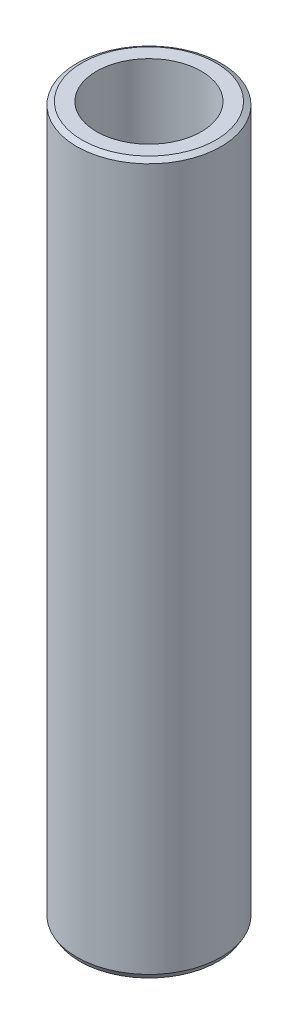
ISO-10303-21;
HEADER;
FILE_DESCRIPTION(('STEP AP214'),'2;1');
FILE_NAME('part.step','',(''),(''),'','','');
FILE_SCHEMA(('AUTOMOTIVE_DESIGN { 1 0 10303 214 1 1 1 1 }'));
ENDSEC;
DATA;
#1=APPLICATION_CONTEXT('core data for automotive mechanical design processes');
#2=APPLICATION_PROTOCOL_DEFINITION('international standard','automotive_design',2000,#1);
#3=PRODUCT_CONTEXT('',#1,'mechanical');
#4=PRODUCT('Part','Part','',(#3));
#5=PRODUCT_RELATED_PRODUCT_CATEGORY('part','',(#4));
#6=PRODUCT_DEFINITION_FORMATION('','',#4);
#7=PRODUCT_DEFINITION_CONTEXT('part definition',#1,'design');
#8=PRODUCT_DEFINITION('design','',#6,#7);
#9=PRODUCT_DEFINITION_SHAPE('','',#8);
#10=(LENGTH_UNIT() NAMED_UNIT(*) SI_UNIT(.MILLI.,.METRE.));
#11=(NAMED_UNIT(*) PLANE_ANGLE_UNIT() SI_UNIT($,.RADIAN.));
#12=(NAMED_UNIT(*) SI_UNIT($,.STERADIAN.) SOLID_ANGLE_UNIT());
#13=UNCERTAINTY_MEASURE_WITH_UNIT(LENGTH_MEASURE(1.E-05),#10,'distance_accuracy_value','');
#14=(GEOMETRIC_REPRESENTATION_CONTEXT(3) GLOBAL_UNCERTAINTY_ASSIGNED_CONTEXT((#13)) GLOBAL_UNIT_ASSIGNED_CONTEXT((#10,
#11,#12)) REPRESENTATION_CONTEXT('',''));
#15=CARTESIAN_POINT('',(0.,0.,0.));
#16=DIRECTION('',(0.,0.,1.));
#17=DIRECTION('',(1.,0.,0.));
#18=AXIS2_PLACEMENT_3D('',#15,#16,#17);
#19=CARTESIAN_POINT('',(0.,590.474866778799,0.));
#20=DIRECTION('',(0.,-1.,0.));
#21=DIRECTION('',(0.,0.,-1.));
#22=AXIS2_PLACEMENT_3D('',#19,#20,#21);
#23=CYLINDRICAL_SURFACE('',#22,60.);
#24=CARTESIAN_POINT('',(0.,587.95142971375,0.));
#25=DIRECTION('',(0.,1.,0.));
#26=DIRECTION('',(0.,0.,1.));
#27=AXIS2_PLACEMENT_3D('',#24,#25,#26);
#28=CIRCLE('',#27,60.);
#29=CARTESIAN_POINT('',(0.,587.95142971375,60.));
#30=VERTEX_POINT('',#29);
#31=EDGE_CURVE('E50',#30,#30,#28,.F.);
#32=ORIENTED_EDGE('',*,*,#31,.T.);
#33=EDGE_LOOP('',(#32));
#34=FACE_BOUND('',#33,.T.);
#35=CARTESIAN_POINT('',(0.,4.37072120636717,0.));
#36=DIRECTION('',(0.,1.,0.));
#37=DIRECTION('',(0.,0.,1.));
#38=AXIS2_PLACEMENT_3D('',#35,#36,#37);
#39=CIRCLE('',#38,60.);
#40=CARTESIAN_POINT('',(0.,4.37072120636717,60.));
#41=VERTEX_POINT('',#40);
#42=EDGE_CURVE('E51',#41,#41,#39,.T.);
#43=ORIENTED_EDGE('',*,*,#42,.T.);
#44=EDGE_LOOP('',(#43));
#45=FACE_BOUND('',#44,.T.);
#46=ADVANCED_FACE('F39',(#34,#45),#23,.T.);
#47=CARTESIAN_POINT('',(0.,590.474866778799,0.));
#48=DIRECTION('',(0.,1.,0.));
#49=DIRECTION('',(0.,0.,1.));
#50=AXIS2_PLACEMENT_3D('',#47,#48,#49);
#51=PLANE('',#50);
#52=CARTESIAN_POINT('',(0.,590.474866778799,0.));
#53=DIRECTION('',(0.,1.,0.));
#54=DIRECTION('',(0.,0.,1.));
#55=AXIS2_PLACEMENT_3D('',#52,#53,#54);
#56=CIRCLE('',#55,55.6292787936328);
#57=CARTESIAN_POINT('',(0.,590.474866778799,55.6292787936328));
#58=VERTEX_POINT('',#57);
#59=EDGE_CURVE('E54',#58,#58,#56,.T.);
#60=ORIENTED_EDGE('',*,*,#59,.T.);
#61=EDGE_LOOP('',(#60));
#62=FACE_BOUND('',#61,.T.);
#63=CARTESIAN_POINT('',(0.,590.474866778799,0.));
#64=DIRECTION('',(0.,1.,0.));
#65=DIRECTION('',(0.,0.,1.));
#66=AXIS2_PLACEMENT_3D('',#63,#64,#65);
#67=CIRCLE('',#66,43.5764125656812);
#68=CARTESIAN_POINT('',(0.,590.474866778799,43.5764125656812));
#69=VERTEX_POINT('',#68);
#70=EDGE_CURVE('E58',#69,#69,#67,.T.);
#71=ORIENTED_EDGE('',*,*,#70,.F.);
#72=EDGE_LOOP('',(#71));
#73=FACE_BOUND('',#72,.T.);
#74=ADVANCED_FACE('F69',(#62,#73),#51,.T.);
#75=CARTESIAN_POINT('',(0.,0.,0.));
#76=DIRECTION('',(0.,1.,0.));
#77=DIRECTION('',(0.,0.,1.));
#78=AXIS2_PLACEMENT_3D('',#75,#76,#77);
#79=PLANE('',#78);
#80=CARTESIAN_POINT('',(0.,0.,0.));
#81=DIRECTION('',(0.,1.,0.));
#82=DIRECTION('',(0.,0.,1.));
#83=AXIS2_PLACEMENT_3D('',#80,#81,#82);
#84=CIRCLE('',#83,57.476562934951);
#85=CARTESIAN_POINT('',(0.,0.,57.476562934951));
#86=VERTEX_POINT('',#85);
#87=EDGE_CURVE('E10',#86,#86,#84,.F.);
#88=ORIENTED_EDGE('',*,*,#87,.T.);
#89=EDGE_LOOP('',(#88));
#90=FACE_BOUND('',#89,.T.);
#91=CARTESIAN_POINT('',(0.,0.,0.));
#92=DIRECTION('',(0.,1.,0.));
#93=DIRECTION('',(0.,0.,1.));
#94=AXIS2_PLACEMENT_3D('',#91,#92,#93);
#95=CIRCLE('',#94,43.5764125656812);
#96=CARTESIAN_POINT('',(0.,0.,43.5764125656812));
#97=VERTEX_POINT('',#96);
#98=EDGE_CURVE('E63',#97,#97,#95,.T.);
#99=ORIENTED_EDGE('',*,*,#98,.T.);
#100=EDGE_LOOP('',(#99));
#101=FACE_BOUND('',#100,.T.);
#102=ADVANCED_FACE('F75',(#90,#101),#79,.F.);
#103=CARTESIAN_POINT('',(0.,590.474866778799,0.));
#104=DIRECTION('',(0.,-1.,0.));
#105=DIRECTION('',(0.,0.,-1.));
#106=AXIS2_PLACEMENT_3D('',#103,#104,#105);
#107=CYLINDRICAL_SURFACE('',#106,43.5764125656812);
#108=ORIENTED_EDGE('',*,*,#70,.T.);
#109=EDGE_LOOP('',(#108));
#110=FACE_BOUND('',#109,.T.);
#111=ORIENTED_EDGE('',*,*,#98,.F.);
#112=EDGE_LOOP('',(#111));
#113=FACE_BOUND('',#112,.T.);
#114=ADVANCED_FACE('F70',(#110,#113),#107,.F.);
#115=CARTESIAN_POINT('',(0.,590.474866778799,0.));
#116=DIRECTION('',(0.,-1.,0.));
#117=DIRECTION('',(0.,0.,-1.));
#118=AXIS2_PLACEMENT_3D('',#115,#116,#117);
#119=CONICAL_SURFACE('',#118,55.6292787936328,1.04719755119659);
#120=ORIENTED_EDGE('',*,*,#31,.F.);
#121=EDGE_LOOP('',(#120));
#122=FACE_BOUND('',#121,.T.);
#123=ORIENTED_EDGE('',*,*,#59,.F.);
#124=EDGE_LOOP('',(#123));
#125=FACE_BOUND('',#124,.T.);
#126=ADVANCED_FACE('F81',(#122,#125),#119,.T.);
#127=CARTESIAN_POINT('',(0.,4.37072120636717,0.));
#128=DIRECTION('',(0.,1.,0.));
#129=DIRECTION('',(0.,0.,1.));
#130=AXIS2_PLACEMENT_3D('',#127,#128,#129);
#131=CONICAL_SURFACE('',#130,60.,0.523598775598315);
#132=ORIENTED_EDGE('',*,*,#87,.F.);
#133=EDGE_LOOP('',(#132));
#134=FACE_BOUND('',#133,.T.);
#135=ORIENTED_EDGE('',*,*,#42,.F.);
#136=EDGE_LOOP('',(#135));
#137=FACE_BOUND('',#136,.T.);
#138=ADVANCED_FACE('F45',(#134,#137),#131,.T.);
#139=CLOSED_SHELL('',(#46,#74,#102,#114,#126,#138));
#140=MANIFOLD_SOLID_BREP('B2',#139);
#141=ADVANCED_BREP_SHAPE_REPRESENTATION('',(#18,#140),#14);
#142=SHAPE_DEFINITION_REPRESENTATION(#9,#141);
ENDSEC;
END-ISO-10303-21;
